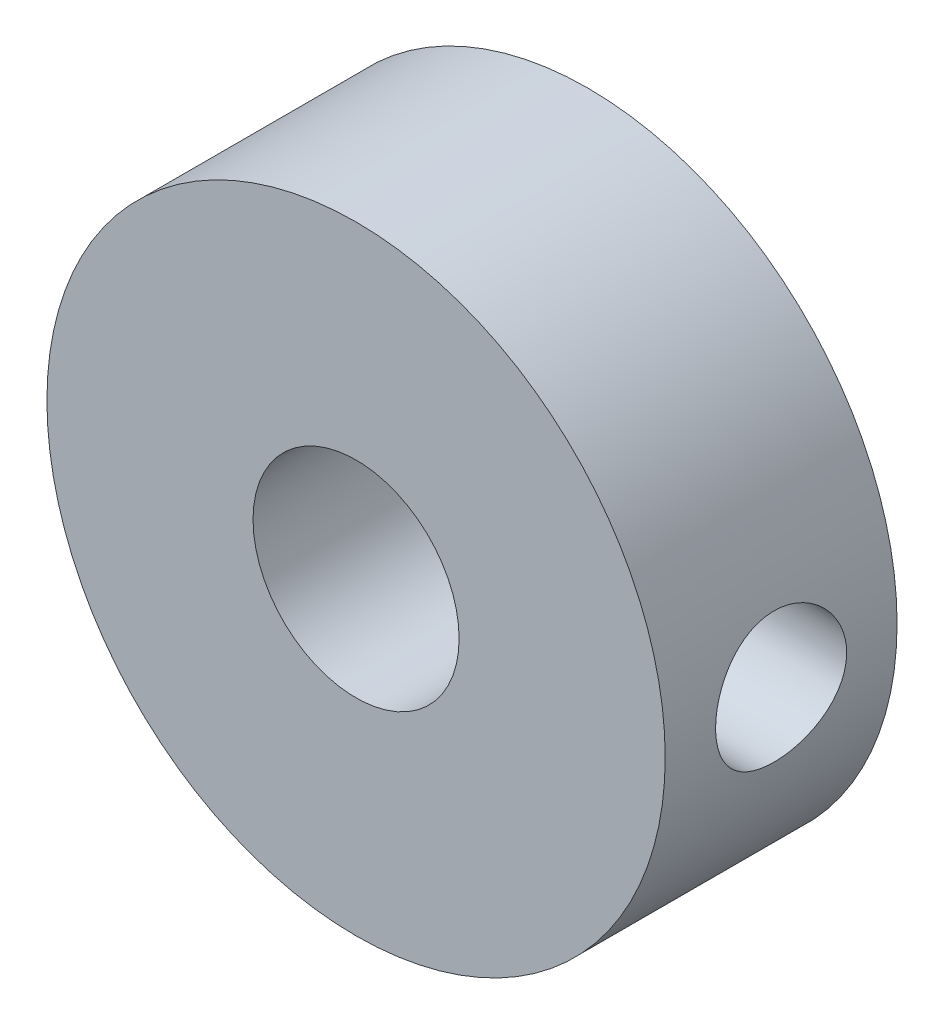
ISO-10303-21;
HEADER;
FILE_DESCRIPTION(('STEP AP214'),'2;1');
FILE_NAME('part.step','',(''),(''),'','','');
FILE_SCHEMA(('AUTOMOTIVE_DESIGN { 1 0 10303 214 1 1 1 1 }'));
ENDSEC;
DATA;
#1=APPLICATION_CONTEXT('core data for automotive mechanical design processes');
#2=APPLICATION_PROTOCOL_DEFINITION('international standard','automotive_design',2000,#1);
#3=PRODUCT_CONTEXT('',#1,'mechanical');
#4=PRODUCT('Part','Part','',(#3));
#5=PRODUCT_RELATED_PRODUCT_CATEGORY('part','',(#4));
#6=PRODUCT_DEFINITION_FORMATION('','',#4);
#7=PRODUCT_DEFINITION_CONTEXT('part definition',#1,'design');
#8=PRODUCT_DEFINITION('design','',#6,#7);
#9=PRODUCT_DEFINITION_SHAPE('','',#8);
#10=(LENGTH_UNIT() NAMED_UNIT(*) SI_UNIT(.MILLI.,.METRE.));
#11=(NAMED_UNIT(*) PLANE_ANGLE_UNIT() SI_UNIT($,.RADIAN.));
#12=(NAMED_UNIT(*) SI_UNIT($,.STERADIAN.) SOLID_ANGLE_UNIT());
#13=UNCERTAINTY_MEASURE_WITH_UNIT(LENGTH_MEASURE(1.E-05),#10,'distance_accuracy_value','');
#14=(GEOMETRIC_REPRESENTATION_CONTEXT(3) GLOBAL_UNCERTAINTY_ASSIGNED_CONTEXT((#13)) GLOBAL_UNIT_ASSIGNED_CONTEXT((#10,
#11,#12)) REPRESENTATION_CONTEXT('',''));
#15=CARTESIAN_POINT('',(0.,0.,0.));
#16=DIRECTION('',(0.,0.,1.));
#17=DIRECTION('',(1.,0.,0.));
#18=AXIS2_PLACEMENT_3D('',#15,#16,#17);
#19=CARTESIAN_POINT('',(0.,0.,3.571875));
#20=DIRECTION('',(0.,0.,1.));
#21=DIRECTION('',(1.,0.,0.));
#22=AXIS2_PLACEMENT_3D('',#19,#20,#21);
#23=PLANE('',#22);
#24=CARTESIAN_POINT('',(0.,0.,3.571875));
#25=DIRECTION('',(0.,0.,1.));
#26=DIRECTION('',(1.,0.,0.));
#27=AXIS2_PLACEMENT_3D('',#24,#25,#26);
#28=CIRCLE('',#27,9.525);
#29=CARTESIAN_POINT('',(9.525,0.,3.571875));
#30=VERTEX_POINT('',#29);
#31=EDGE_CURVE('E11',#30,#30,#28,.T.);
#32=ORIENTED_EDGE('',*,*,#31,.T.);
#33=EDGE_LOOP('',(#32));
#34=FACE_BOUND('',#33,.T.);
#35=CARTESIAN_POINT('',(0.,0.,3.571875));
#36=DIRECTION('',(0.,0.,1.));
#37=DIRECTION('',(1.,0.,0.));
#38=AXIS2_PLACEMENT_3D('',#35,#36,#37);
#39=CIRCLE('',#38,3.175);
#40=CARTESIAN_POINT('',(3.175,0.,3.571875));
#41=VERTEX_POINT('',#40);
#42=EDGE_CURVE('E63',#41,#41,#39,.T.);
#43=ORIENTED_EDGE('',*,*,#42,.F.);
#44=EDGE_LOOP('',(#43));
#45=FACE_BOUND('',#44,.T.);
#46=ADVANCED_FACE('F38',(#34,#45),#23,.T.);
#47=CARTESIAN_POINT('',(0.,0.,-3.571875));
#48=DIRECTION('',(0.,0.,1.));
#49=DIRECTION('',(1.,0.,0.));
#50=AXIS2_PLACEMENT_3D('',#47,#48,#49);
#51=PLANE('',#50);
#52=CARTESIAN_POINT('',(0.,0.,-3.571875));
#53=DIRECTION('',(0.,0.,1.));
#54=DIRECTION('',(1.,0.,0.));
#55=AXIS2_PLACEMENT_3D('',#52,#53,#54);
#56=CIRCLE('',#55,9.525);
#57=CARTESIAN_POINT('',(9.525,0.,-3.571875));
#58=VERTEX_POINT('',#57);
#59=EDGE_CURVE('E43',#58,#58,#56,.T.);
#60=ORIENTED_EDGE('',*,*,#59,.F.);
#61=EDGE_LOOP('',(#60));
#62=FACE_BOUND('',#61,.T.);
#63=CARTESIAN_POINT('',(0.,0.,-3.571875));
#64=DIRECTION('',(0.,0.,1.));
#65=DIRECTION('',(1.,0.,0.));
#66=AXIS2_PLACEMENT_3D('',#63,#64,#65);
#67=CIRCLE('',#66,3.175);
#68=CARTESIAN_POINT('',(3.175,0.,-3.571875));
#69=VERTEX_POINT('',#68);
#70=EDGE_CURVE('E61',#69,#69,#67,.T.);
#71=ORIENTED_EDGE('',*,*,#70,.T.);
#72=EDGE_LOOP('',(#71));
#73=FACE_BOUND('',#72,.T.);
#74=ADVANCED_FACE('F86',(#62,#73),#51,.F.);
#75=CARTESIAN_POINT('',(0.,0.,3.571875));
#76=DIRECTION('',(0.,0.,-1.));
#77=DIRECTION('',(-1.,0.,0.));
#78=AXIS2_PLACEMENT_3D('',#75,#76,#77);
#79=CYLINDRICAL_SURFACE('',#78,9.525);
#80=CARTESIAN_POINT('',(9.525,0.,-2.01929999999999));
#81=CARTESIAN_POINT('',(9.52499792551503,-0.112080793303479,-2.01929605777023));
#82=CARTESIAN_POINT('',(9.52300153831146,-0.224210016439576,-2.00993695602122));
#83=CARTESIAN_POINT('',(9.51523028185822,-0.445289201818457,-1.97278331779188));
#84=CARTESIAN_POINT('',(9.50945260131313,-0.554236735551322,-1.94497506462566));
#85=CARTESIAN_POINT('',(9.49476274590896,-0.765725020631265,-1.87182869488699));
#86=CARTESIAN_POINT('',(9.48585374640463,-0.868272138812788,-1.82650833208778));
#87=CARTESIAN_POINT('',(9.46586534508673,-1.06430217453373,-1.71967926632438));
#88=CARTESIAN_POINT('',(9.45478602616112,-1.1577854380325,-1.6581711815644));
#89=CARTESIAN_POINT('',(9.43148541963988,-1.33445303705641,-1.51972743316351));
#90=CARTESIAN_POINT('',(9.4192506885355,-1.41748059699463,-1.44259395307994));
#91=CARTESIAN_POINT('',(9.3951140370069,-1.56952124140009,-1.2755138405273));
#92=CARTESIAN_POINT('',(9.38321214492656,-1.63853313543687,-1.18556612077479));
#93=CARTESIAN_POINT('',(9.36095669328306,-1.76126616168016,-0.994263232035407));
#94=CARTESIAN_POINT('',(9.350620387254,-1.814822076558,-0.892799879691048));
#95=CARTESIAN_POINT('',(9.33285866001451,-1.90406360430188,-0.682058607140497));
#96=CARTESIAN_POINT('',(9.32543291331412,-1.93975121551714,-0.572781562362223));
#97=CARTESIAN_POINT('',(9.31446967453331,-1.9917283356121,-0.351210499255021));
#98=CARTESIAN_POINT('',(9.31087678517456,-2.00829450772184,-0.238984180481624));
#99=CARTESIAN_POINT('',(9.30781955421734,-2.0224184155205,-0.0132920393403892));
#100=CARTESIAN_POINT('',(9.30835473686731,-2.01997834163871,0.100173638688864));
#101=CARTESIAN_POINT('',(9.31344296115913,-1.99638204846261,0.323078989219815));
#102=CARTESIAN_POINT('',(9.31792734316076,-1.97554564675925,0.432554320342606));
#103=CARTESIAN_POINT('',(9.33030030040888,-1.91625416516191,0.646419351323386));
#104=CARTESIAN_POINT('',(9.33818905622286,-1.87779815071956,0.750808781099022));
#105=CARTESIAN_POINT('',(9.35655049065993,-1.78406110707322,0.952446176631024));
#106=CARTESIAN_POINT('',(9.3670421570151,-1.72865571037207,1.04963452561437));
#107=CARTESIAN_POINT('',(9.38941542313879,-1.6026802148688,1.23345349591639));
#108=CARTESIAN_POINT('',(9.40129720137485,-1.53210816794235,1.32008275870035));
#109=CARTESIAN_POINT('',(9.42540756632707,-1.37610254064696,1.48216731179898));
#110=CARTESIAN_POINT('',(9.43763830001525,-1.29039662998361,1.55736041030654));
#111=CARTESIAN_POINT('',(9.46084863406391,-1.10745482608439,1.69234701569915));
#112=CARTESIAN_POINT('',(9.47182821434208,-1.01021874782833,1.75214027542001));
#113=CARTESIAN_POINT('',(9.49133145743276,-0.806667393476975,1.85468862925615));
#114=CARTESIAN_POINT('',(9.49985039301163,-0.700335143472221,1.8974109873897));
#115=CARTESIAN_POINT('',(9.51343711224788,-0.481780861161361,1.9643103532469));
#116=CARTESIAN_POINT('',(9.51850536671464,-0.369559634595865,1.98848989100149));
#117=CARTESIAN_POINT('',(9.52455318812467,-0.144663456266961,2.01723964459118));
#118=CARTESIAN_POINT('',(9.52560747371218,-0.0320362705854655,2.02216825533947));
#119=CARTESIAN_POINT('',(9.5237172693936,0.19243213059723,2.01324537008707));
#120=CARTESIAN_POINT('',(9.52077303346761,0.304273395565382,1.999395066895));
#121=CARTESIAN_POINT('',(9.51126361053663,0.522819247667638,1.95360493056016));
#122=CARTESIAN_POINT('',(9.50473576770227,0.629564673642305,1.92185157143095));
#123=CARTESIAN_POINT('',(9.48878918215586,0.83621497652458,1.8413624774382));
#124=CARTESIAN_POINT('',(9.47937020369021,0.936119294770794,1.79262535761387));
#125=CARTESIAN_POINT('',(9.45850108054137,1.1277443609961,1.67879496086358));
#126=CARTESIAN_POINT('',(9.44702516661175,1.21933602427829,1.61348920697773));
#127=CARTESIAN_POINT('',(9.42337054563978,1.39038918530086,1.46865684588711));
#128=CARTESIAN_POINT('',(9.41119175334924,1.46984920738405,1.38912851123997));
#129=CARTESIAN_POINT('',(9.38724819394352,1.61578809956368,1.21646854591607));
#130=CARTESIAN_POINT('',(9.37549418447709,1.68201955573512,1.12312603029091));
#131=CARTESIAN_POINT('',(9.35397178269472,1.79786615991147,0.926431328313715));
#132=CARTESIAN_POINT('',(9.34420330646356,1.84748201020444,0.823079565258392));
#133=CARTESIAN_POINT('',(9.32784749520953,1.92836475345828,0.609844578693756));
#134=CARTESIAN_POINT('',(9.3212427553657,1.95973224666489,0.500000914217797));
#135=CARTESIAN_POINT('',(9.31192869583124,2.00352672940945,0.276444994928691));
#136=CARTESIAN_POINT('',(9.30921879629105,2.01595653833702,0.162733318551878));
#137=CARTESIAN_POINT('',(9.30803619569186,2.02140852637827,-0.0628401901754179));
#138=CARTESIAN_POINT('',(9.30947795978875,2.01482247313902,-0.174692285500888));
#139=CARTESIAN_POINT('',(9.3162436530071,1.98330139142576,-0.395654559508603));
#140=CARTESIAN_POINT('',(9.32156754199072,1.95836655266234,-0.504764766527543));
#141=CARTESIAN_POINT('',(9.33545717665887,1.89103972956776,-0.716857652732554));
#142=CARTESIAN_POINT('',(9.34401294083237,1.8487014598517,-0.819858079794297));
#143=CARTESIAN_POINT('',(9.3634068387722,1.74781702354493,-1.01735305646432));
#144=CARTESIAN_POINT('',(9.37424519349784,1.68926928767298,-1.11184678134195));
#145=CARTESIAN_POINT('',(9.39724086826711,1.55631419925815,-1.2915845614883));
#146=CARTESIAN_POINT('',(9.40941936241776,1.48162625264157,-1.3766183867179));
#147=CARTESIAN_POINT('',(9.43357733750332,1.31908354320854,-1.53307482734645));
#148=CARTESIAN_POINT('',(9.44555677192061,1.23122574953632,-1.60449430097584));
#149=CARTESIAN_POINT('',(9.46813741264567,1.04356508531551,-1.73251311457618));
#150=CARTESIAN_POINT('',(9.47872031138771,0.943631266888526,-1.7889238939105));
#151=CARTESIAN_POINT('',(9.49713321935556,0.735500311057139,-1.88405951682441));
#152=CARTESIAN_POINT('',(9.50496560015185,0.62731039076533,-1.92279960520683));
#153=CARTESIAN_POINT('',(9.5155513710563,0.432467352285953,-1.97436751622215));
#154=CARTESIAN_POINT('',(9.51907311193511,0.346889585642876,-1.9911858385908));
#155=CARTESIAN_POINT('',(9.52379818699899,0.174217593769683,-2.01365339259177));
#156=CARTESIAN_POINT('',(9.52500161255321,0.0871234284401882,-2.01930306440169));
#157=CARTESIAN_POINT('',(9.525,0.,-2.01929999999999));
#158=B_SPLINE_CURVE_WITH_KNOTS('',3,(#80,#81,#82,#83,#84,#85,#86,#87,#88,#89,#90,#91,#92,#93,
#94,#95,#96,#97,#98,#99,#100,#101,#102,#103,#104,#105,#106,#107,#108,#109,#110,#111,#112,#113,
#114,#115,#116,#117,#118,#119,#120,#121,#122,#123,#124,#125,#126,#127,#128,#129,#130,#131,#132,
#133,#134,#135,#136,#137,#138,#139,#140,#141,#142,#143,#144,#145,#146,#147,#148,#149,#150,#151,
#152,#153,#154,#155,#156,#157),.UNSPECIFIED.,.T.,.F.,(4,2,2,2,2,2,2,2,2,2,2,2,2,2,2,2,2,2,2,2,2,
2,2,2,2,2,2,2,2,2,2,2,2,2,2,2,2,2,4),(0.,0.335923541769575,0.672097118298831,1.00793077253339,
1.3437516032425,1.68412441172818,2.02452611793904,2.36844212876765,2.7123196682394,
3.05115677107679,3.38995482423889,3.72297640706886,4.05601565548631,4.39155972986145,
4.72714692995474,5.06953880801044,5.41193618104149,5.7549870363813,6.09799107663274,
6.43457808181871,6.77114370850142,7.1042668431524,7.43741714908168,7.77507719452603,
8.11277827928042,8.45630137257434,8.79980994442207,9.14140641117286,9.48295201702331,
9.81751157318998,10.1520676703485,10.4855988428321,10.8191623166477,11.1590732121291,
11.4990624537804,11.8431405024904,12.1869211452106,12.4480538809705,12.709176324791),.UNSPECIFIED.);
#159=CARTESIAN_POINT('',(9.525,0.,2.01929999999999));
#160=VERTEX_POINT('',#159);
#161=CARTESIAN_POINT('',(9.525,0.,-2.01929999999999));
#162=VERTEX_POINT('',#161);
#163=EDGE_CURVE('E55',#160,#162,#158,.T.);
#164=ORIENTED_EDGE('',*,*,#163,.T.);
#165=EDGE_CURVE('E53',#162,#160,#158,.T.);
#166=ORIENTED_EDGE('',*,*,#165,.T.);
#167=EDGE_LOOP('',(#164,#166));
#168=FACE_BOUND('',#167,.T.);
#169=ORIENTED_EDGE('',*,*,#31,.F.);
#170=EDGE_LOOP('',(#169));
#171=FACE_BOUND('',#170,.T.);
#172=ORIENTED_EDGE('',*,*,#59,.T.);
#173=EDGE_LOOP('',(#172));
#174=FACE_BOUND('',#173,.T.);
#175=ADVANCED_FACE('F40',(#168,#171,#174),#79,.T.);
#176=CARTESIAN_POINT('',(0.,0.,3.571875));
#177=DIRECTION('',(0.,0.,-1.));
#178=DIRECTION('',(-1.,0.,0.));
#179=AXIS2_PLACEMENT_3D('',#176,#177,#178);
#180=CYLINDRICAL_SURFACE('',#179,3.175);
#181=CARTESIAN_POINT('',(3.175,0.,-2.01929999999999));
#182=CARTESIAN_POINT('',(3.17499212218742,-0.102275041570351,-2.01929143965553));
#183=CARTESIAN_POINT('',(3.17000679874075,-0.204663948744718,-2.01147696356883));
#184=CARTESIAN_POINT('',(3.15053510862914,-0.406278072049933,-1.98064527104775));
#185=CARTESIAN_POINT('',(3.13603219182987,-0.505497460962833,-1.95760157203822));
#186=CARTESIAN_POINT('',(3.09897945913749,-0.697469668100846,-1.89767536654758));
#187=CARTESIAN_POINT('',(3.07646968317457,-0.790251965874983,-1.86086167332953));
#188=CARTESIAN_POINT('',(3.02526013654449,-0.967983856054422,-1.77491840151875));
#189=CARTESIAN_POINT('',(2.9965608310332,-1.05293403637499,-1.72578974837558));
#190=CARTESIAN_POINT('',(2.93256277924019,-1.22039873226055,-1.61222031168926));
#191=CARTESIAN_POINT('',(2.89691724195524,-1.3021541541713,-1.54685956659122));
#192=CARTESIAN_POINT('',(2.82362413681097,-1.45427585258572,-1.40481514759952));
#193=CARTESIAN_POINT('',(2.78597386455601,-1.52462619854515,-1.32811591706343));
#194=CARTESIAN_POINT('',(2.70653031413333,-1.66206543309412,-1.15291312688874));
#195=CARTESIAN_POINT('',(2.66490287506758,-1.72729055130935,-1.05285997830798));
#196=CARTESIAN_POINT('',(2.58848866777313,-1.83983395520866,-0.840790700687558));
#197=CARTESIAN_POINT('',(2.55369025311667,-1.88718285725214,-0.72879545063197));
#198=CARTESIAN_POINT('',(2.50463798235853,-1.95156224001302,-0.526353573531236));
#199=CARTESIAN_POINT('',(2.48737926319143,-1.97331282288364,-0.438141599180129));
#200=CARTESIAN_POINT('',(2.46209734155056,-2.00477482055267,-0.258355877350788));
#201=CARTESIAN_POINT('',(2.45406037559985,-2.01450417871409,-0.166787350887033));
#202=CARTESIAN_POINT('',(2.44844089318852,-2.02133295126505,0.0174264440076886));
#203=CARTESIAN_POINT('',(2.45088932499695,-2.01839497710359,0.110074093877144));
#204=CARTESIAN_POINT('',(2.46591124637832,-2.00000919911576,0.293308921800894));
#205=CARTESIAN_POINT('',(2.47849303179026,-1.98455114545894,0.383894349078537));
#206=CARTESIAN_POINT('',(2.5114634605905,-1.94264067552021,0.558156605747084));
#207=CARTESIAN_POINT('',(2.531624868821,-1.91650651911699,0.641955591631327));
#208=CARTESIAN_POINT('',(2.5775203144075,-1.85432038094186,0.804126859953402));
#209=CARTESIAN_POINT('',(2.60325621174054,-1.8182650878077,0.882497319569275));
#210=CARTESIAN_POINT('',(2.66335210414009,-1.72932876824588,1.04756420862492));
#211=CARTESIAN_POINT('',(2.6984196544858,-1.67454743777151,1.1329781231468));
#212=CARTESIAN_POINT('',(2.77005411277688,-1.55319088466405,1.29436513819511));
#213=CARTESIAN_POINT('',(2.80662274219305,-1.48660181281294,1.37032697243656));
#214=CARTESIAN_POINT('',(2.88474864185399,-1.32960028569559,1.52442980683521));
#215=CARTESIAN_POINT('',(2.92603774183837,-1.23705711933929,1.60055964392835));
#216=CARTESIAN_POINT('',(3.00234660451871,-1.03819212296361,1.73613496814226));
#217=CARTESIAN_POINT('',(3.03737313810322,-0.931885390793913,1.79559851431009));
#218=CARTESIAN_POINT('',(3.09131764246758,-0.730092345463672,1.88525833040918));
#219=CARTESIAN_POINT('',(3.11205186463951,-0.636630347052195,1.91891814909189));
#220=CARTESIAN_POINT('',(3.14525139549152,-0.44441356966353,1.9723071130987));
#221=CARTESIAN_POINT('',(3.15772328793695,-0.345663072769132,1.99204735092908));
#222=CARTESIAN_POINT('',(3.17327247447325,-0.145247031750997,2.01660545426343));
#223=CARTESIAN_POINT('',(3.17631951183841,-0.0435731547102205,2.02137526073012));
#224=CARTESIAN_POINT('',(3.17262837891011,0.159161564830493,2.01557027759349));
#225=CARTESIAN_POINT('',(3.16588947737162,0.260222360951872,2.0049943412941));
#226=CARTESIAN_POINT('',(3.14386957546433,0.453545546030752,1.97003398927967));
#227=CARTESIAN_POINT('',(3.12903933230956,0.545994183259854,1.9463774142151));
#228=CARTESIAN_POINT('',(3.09238314692143,0.725383942286242,1.88688328974225));
#229=CARTESIAN_POINT('',(3.07055602506331,0.812324132435726,1.85104368629908));
#230=CARTESIAN_POINT('',(3.01962653249605,0.985513554819464,1.76532469067284));
#231=CARTESIAN_POINT('',(2.99009760848239,1.07120913338102,1.71458591832282));
#232=CARTESIAN_POINT('',(2.92697501640169,1.23329766280981,1.60196928369765));
#233=CARTESIAN_POINT('',(2.89337810863513,1.30968310074507,1.54008252389905));
#234=CARTESIAN_POINT('',(2.81925311715627,1.46312883138038,1.39624590798107));
#235=CARTESIAN_POINT('',(2.77844582051285,1.5385399767099,1.31267704038414));
#236=CARTESIAN_POINT('',(2.69848578412998,1.67482589073676,1.13366099064735));
#237=CARTESIAN_POINT('',(2.65933325774613,1.73569878964202,1.03821228301693));
#238=CARTESIAN_POINT('',(2.59242399914096,1.83384260188465,0.85094873261184));
#239=CARTESIAN_POINT('',(2.56383843593366,1.87323995547865,0.760551475860484));
#240=CARTESIAN_POINT('',(2.51461975244491,1.93881492302713,0.573063022843393));
#241=CARTESIAN_POINT('',(2.4939754469369,1.96501114696942,0.475981470452249));
#242=CARTESIAN_POINT('',(2.46366295169804,2.00290039729267,0.276327215660933));
#243=CARTESIAN_POINT('',(2.45409505725333,2.01446098670787,0.173713009964135));
#244=CARTESIAN_POINT('',(2.44816666813602,2.02166710369554,-0.0324330820703782));
#245=CARTESIAN_POINT('',(2.4517981050102,2.01732235383119,-0.135964369215067));
#246=CARTESIAN_POINT('',(2.47012079556712,1.99481282731698,-0.325826720148383));
#247=CARTESIAN_POINT('',(2.48322286589143,1.97863020035238,-0.412565611577873));
#248=CARTESIAN_POINT('',(2.51688812246692,1.93562453165795,-0.581868836145926));
#249=CARTESIAN_POINT('',(2.53745848413263,1.9087912546343,-0.664429067280153));
#250=CARTESIAN_POINT('',(2.59188888887618,1.83453213645738,-0.85171779929931));
#251=CARTESIAN_POINT('',(2.62788562529029,1.78319601633737,-0.954273049947508));
#252=CARTESIAN_POINT('',(2.70432924352511,1.66498968273404,-1.14817919342465));
#253=CARTESIAN_POINT('',(2.74478205404976,1.59809863913568,-1.23951480877444));
#254=CARTESIAN_POINT('',(2.82622298925022,1.4492614573701,-1.41074698784759));
#255=CARTESIAN_POINT('',(2.86721208276524,1.3671568638917,-1.49050573592319));
#256=CARTESIAN_POINT('',(2.94534120010865,1.18954498293631,-1.63576450612535));
#257=CARTESIAN_POINT('',(2.98248124750827,1.09403777754424,-1.70126461557333));
#258=CARTESIAN_POINT('',(3.05013846389934,0.888385881992069,-1.8172993376485));
#259=CARTESIAN_POINT('',(3.08046045600151,0.777927590640475,-1.86740513314878));
#260=CARTESIAN_POINT('',(3.11730041421457,0.605427728914395,-1.9273677860614));
#261=CARTESIAN_POINT('',(3.12813464368599,0.546842243784912,-1.94481471910601));
#262=CARTESIAN_POINT('',(3.14661127671427,0.427869843173634,-1.97439774274739));
#263=CARTESIAN_POINT('',(3.15425595157205,0.367484242510023,-1.9865376128308));
#264=CARTESIAN_POINT('',(3.16507251999973,0.255971221121611,-2.00366340176665));
#265=CARTESIAN_POINT('',(3.16878594100635,0.205027735964817,-2.00951801938967));
#266=CARTESIAN_POINT('',(3.17375169673817,0.102732421224252,-2.01733852709741));
#267=CARTESIAN_POINT('',(3.17500395762807,0.051380579436101,-2.01930430051605));
#268=CARTESIAN_POINT('',(3.175,0.,-2.01929999999999));
#269=B_SPLINE_CURVE_WITH_KNOTS('',3,(#181,#182,#183,#184,#185,#186,#187,#188,#189,#190,#191,
#192,#193,#194,#195,#196,#197,#198,#199,#200,#201,#202,#203,#204,#205,#206,#207,#208,#209,#210,
#211,#212,#213,#214,#215,#216,#217,#218,#219,#220,#221,#222,#223,#224,#225,#226,#227,#228,#229,
#230,#231,#232,#233,#234,#235,#236,#237,#238,#239,#240,#241,#242,#243,#244,#245,#246,#247,#248,
#249,#250,#251,#252,#253,#254,#255,#256,#257,#258,#259,#260,#261,#262,#263,#264,#265,#266,#267,
#268),.UNSPECIFIED.,.T.,.F.,(4,2,2,2,2,2,2,2,2,2,2,2,2,2,2,2,2,2,2,2,2,2,2,2,2,2,2,2,2,2,2,2,2,
2,2,2,2,2,2,2,2,2,2,4),(0.,0.306618688447366,0.613771973685193,0.919410384700766,
1.2250258343603,1.55547991466606,1.88639166683373,2.26403741166171,2.64103340143298,
2.91733101609382,3.19321571765492,3.46991526949969,3.7468415765855,4.01605368121483,
4.28535574956628,4.60626536454537,4.92755389229748,5.3059319215214,5.68389835350099,
5.98703820526839,6.28993621120917,6.59380561032803,6.89769771696903,7.18617094760006,
7.47469283839889,7.78512110231493,8.09579823449314,8.45351764572918,8.81128303920727,
9.11810928918366,9.42450177937297,9.73364742929525,10.0426041372508,10.3090843788023,
10.5758213307902,10.9345409073162,11.293743651991,11.6569225744499,12.0200992726999,
12.3926282643871,12.5785937254861,12.7644265325087,12.918459941123,13.0724979706996),.UNSPECIFIED.);
#270=CARTESIAN_POINT('',(3.175,0.,-2.01929999999999));
#271=VERTEX_POINT('',#270);
#272=EDGE_CURVE('E58',#271,#271,#269,.T.);
#273=ORIENTED_EDGE('',*,*,#272,.F.);
#274=EDGE_LOOP('',(#273));
#275=FACE_BOUND('',#274,.T.);
#276=ORIENTED_EDGE('',*,*,#42,.T.);
#277=EDGE_LOOP('',(#276));
#278=FACE_BOUND('',#277,.T.);
#279=ORIENTED_EDGE('',*,*,#70,.F.);
#280=EDGE_LOOP('',(#279));
#281=FACE_BOUND('',#280,.T.);
#282=ADVANCED_FACE('F77',(#275,#278,#281),#180,.F.);
#283=CARTESIAN_POINT('',(9.525,0.,0.));
#284=DIRECTION('',(1.,0.,0.));
#285=DIRECTION('',(0.,0.,-1.));
#286=AXIS2_PLACEMENT_3D('',#283,#284,#285);
#287=CYLINDRICAL_SURFACE('',#286,2.01929999999999);
#288=ORIENTED_EDGE('',*,*,#272,.T.);
#289=EDGE_LOOP('',(#288));
#290=FACE_BOUND('',#289,.T.);
#291=ORIENTED_EDGE('',*,*,#163,.F.);
#292=ORIENTED_EDGE('',*,*,#165,.F.);
#293=EDGE_LOOP('',(#291,#292));
#294=FACE_BOUND('',#293,.T.);
#295=ADVANCED_FACE('F56',(#290,#294),#287,.F.);
#296=CLOSED_SHELL('',(#46,#74,#175,#282,#295));
#297=MANIFOLD_SOLID_BREP('B2',#296);
#298=ADVANCED_BREP_SHAPE_REPRESENTATION('',(#18,#297),#14);
#299=SHAPE_DEFINITION_REPRESENTATION(#9,#298);
ENDSEC;
END-ISO-10303-21;
